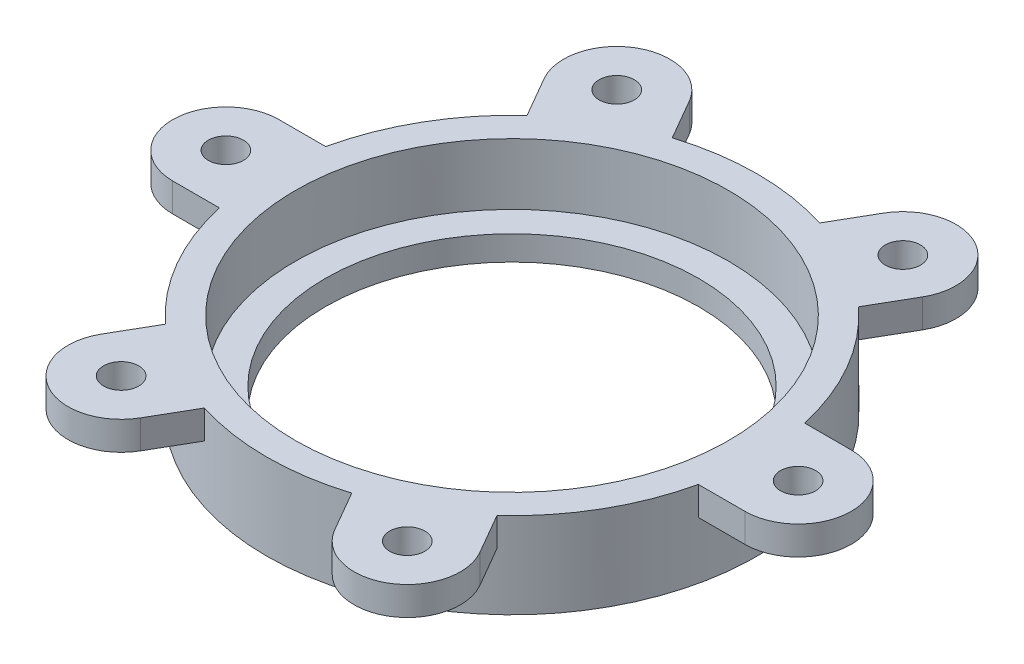
ISO-10303-21;
HEADER;
FILE_DESCRIPTION(('STEP AP214'),'2;1');
FILE_NAME('part.step','',(''),(''),'','','');
FILE_SCHEMA(('AUTOMOTIVE_DESIGN { 1 0 10303 214 1 1 1 1 }'));
ENDSEC;
DATA;
#1=APPLICATION_CONTEXT('core data for automotive mechanical design processes');
#2=APPLICATION_PROTOCOL_DEFINITION('international standard','automotive_design',2000,#1);
#3=PRODUCT_CONTEXT('',#1,'mechanical');
#4=PRODUCT('Part','Part','',(#3));
#5=PRODUCT_RELATED_PRODUCT_CATEGORY('part','',(#4));
#6=PRODUCT_DEFINITION_FORMATION('','',#4);
#7=PRODUCT_DEFINITION_CONTEXT('part definition',#1,'design');
#8=PRODUCT_DEFINITION('design','',#6,#7);
#9=PRODUCT_DEFINITION_SHAPE('','',#8);
#10=(LENGTH_UNIT() NAMED_UNIT(*) SI_UNIT(.MILLI.,.METRE.));
#11=(NAMED_UNIT(*) PLANE_ANGLE_UNIT() SI_UNIT($,.RADIAN.));
#12=(NAMED_UNIT(*) SI_UNIT($,.STERADIAN.) SOLID_ANGLE_UNIT());
#13=UNCERTAINTY_MEASURE_WITH_UNIT(LENGTH_MEASURE(1.E-05),#10,'distance_accuracy_value','');
#14=(GEOMETRIC_REPRESENTATION_CONTEXT(3) GLOBAL_UNCERTAINTY_ASSIGNED_CONTEXT((#13)) GLOBAL_UNIT_ASSIGNED_CONTEXT((#10,
#11,#12)) REPRESENTATION_CONTEXT('',''));
#15=CARTESIAN_POINT('',(0.,0.,0.));
#16=DIRECTION('',(0.,0.,1.));
#17=DIRECTION('',(1.,0.,0.));
#18=AXIS2_PLACEMENT_3D('',#15,#16,#17);
#19=CARTESIAN_POINT('',(35.,0.,0.));
#20=DIRECTION('',(0.,1.,0.));
#21=DIRECTION('',(0.,0.,1.));
#22=AXIS2_PLACEMENT_3D('',#19,#20,#21);
#23=PLANE('',#22);
#24=CARTESIAN_POINT('',(0.,0.,0.));
#25=DIRECTION('',(0.,-1.,0.));
#26=DIRECTION('',(0.,0.,-1.));
#27=AXIS2_PLACEMENT_3D('',#24,#25,#26);
#28=CIRCLE('',#27,22.85);
#29=CARTESIAN_POINT('',(0.,0.,-22.85));
#30=VERTEX_POINT('',#29);
#31=EDGE_CURVE('E281',#30,#30,#28,.T.);
#32=ORIENTED_EDGE('',*,*,#31,.F.);
#33=EDGE_LOOP('',(#32));
#34=FACE_BOUND('',#33,.T.);
#35=CARTESIAN_POINT('',(0.,0.,0.));
#36=DIRECTION('',(0.,1.,0.));
#37=DIRECTION('',(0.,0.,1.));
#38=AXIS2_PLACEMENT_3D('',#35,#36,#37);
#39=CIRCLE('',#38,30.);
#40=CARTESIAN_POINT('',(0.,0.,30.));
#41=VERTEX_POINT('',#40);
#42=EDGE_CURVE('E305',#41,#41,#39,.T.);
#43=ORIENTED_EDGE('',*,*,#42,.F.);
#44=EDGE_LOOP('',(#43));
#45=FACE_BOUND('',#44,.T.);
#46=ADVANCED_FACE('F35',(#34,#45),#23,.F.);
#47=CARTESIAN_POINT('',(35.,10.5,0.));
#48=DIRECTION('',(0.,-1.,0.));
#49=DIRECTION('',(0.,0.,-1.));
#50=AXIS2_PLACEMENT_3D('',#47,#48,#49);
#51=CYLINDRICAL_SURFACE('',#50,6.5);
#52=CARTESIAN_POINT('',(35.,7.,0.));
#53=DIRECTION('',(0.,-1.,0.));
#54=DIRECTION('',(0.,0.,-1.));
#55=AXIS2_PLACEMENT_3D('',#52,#53,#54);
#56=CIRCLE('',#55,6.5);
#57=CARTESIAN_POINT('',(35.,7.,-6.5));
#58=VERTEX_POINT('',#57);
#59=CARTESIAN_POINT('',(35.,7.,6.5));
#60=VERTEX_POINT('',#59);
#61=EDGE_CURVE('E251',#58,#60,#56,.T.);
#62=ORIENTED_EDGE('',*,*,#61,.F.);
#63=DIRECTION('',(0.,-1.,0.));
#64=VECTOR('',#63,1.);
#65=CARTESIAN_POINT('',(35.,10.5,-6.5));
#66=LINE('',#65,#64);
#67=CARTESIAN_POINT('',(35.,10.5,-6.5));
#68=VERTEX_POINT('',#67);
#69=EDGE_CURVE('E11',#68,#58,#66,.T.);
#70=ORIENTED_EDGE('',*,*,#69,.F.);
#71=CARTESIAN_POINT('',(35.,10.5,0.));
#72=DIRECTION('',(0.,1.,0.));
#73=DIRECTION('',(0.,0.,1.));
#74=AXIS2_PLACEMENT_3D('',#71,#72,#73);
#75=CIRCLE('',#74,6.5);
#76=CARTESIAN_POINT('',(35.,10.5,6.5));
#77=VERTEX_POINT('',#76);
#78=EDGE_CURVE('E306',#77,#68,#75,.T.);
#79=ORIENTED_EDGE('',*,*,#78,.F.);
#80=DIRECTION('',(0.,-1.,0.));
#81=VECTOR('',#80,1.);
#82=CARTESIAN_POINT('',(35.,10.5,6.5));
#83=LINE('',#82,#81);
#84=EDGE_CURVE('E350',#77,#60,#83,.T.);
#85=ORIENTED_EDGE('',*,*,#84,.T.);
#86=EDGE_LOOP('',(#62,#70,#79,#85));
#87=FACE_BOUND('',#86,.T.);
#88=ADVANCED_FACE('F37',(#87),#51,.T.);
#89=CARTESIAN_POINT('',(35.,10.5,-6.5));
#90=DIRECTION('',(0.,0.,1.));
#91=DIRECTION('',(1.,0.,0.));
#92=AXIS2_PLACEMENT_3D('',#89,#90,#91);
#93=PLANE('',#92);
#94=DIRECTION('',(1.,0.,0.));
#95=VECTOR('',#94,1.);
#96=CARTESIAN_POINT('',(35.,7.,-6.5));
#97=LINE('',#96,#95);
#98=CARTESIAN_POINT('',(29.2873692912149,7.,-6.5));
#99=VERTEX_POINT('',#98);
#100=EDGE_CURVE('E246',#99,#58,#97,.T.);
#101=ORIENTED_EDGE('',*,*,#100,.F.);
#102=DIRECTION('',(0.,-1.,0.));
#103=VECTOR('',#102,1.);
#104=CARTESIAN_POINT('',(29.2873692912149,10.5,-6.5));
#105=LINE('',#104,#103);
#106=CARTESIAN_POINT('',(29.2873692912149,10.5,-6.5));
#107=VERTEX_POINT('',#106);
#108=EDGE_CURVE('E44',#107,#99,#105,.T.);
#109=ORIENTED_EDGE('',*,*,#108,.F.);
#110=DIRECTION('',(-1.,0.,0.));
#111=VECTOR('',#110,1.);
#112=CARTESIAN_POINT('',(35.,10.5,-6.5));
#113=LINE('',#112,#111);
#114=EDGE_CURVE('E245',#68,#107,#113,.T.);
#115=ORIENTED_EDGE('',*,*,#114,.F.);
#116=ORIENTED_EDGE('',*,*,#69,.T.);
#117=EDGE_LOOP('',(#101,#109,#115,#116));
#118=FACE_BOUND('',#117,.T.);
#119=ADVANCED_FACE('F244',(#118),#93,.F.);
#120=CARTESIAN_POINT('',(23.1291651245992,10.5,-27.0608891324551));
#121=DIRECTION('',(-0.866025403784433,0.,-0.50000000000001));
#122=DIRECTION('',(-0.50000000000001,0.,0.866025403784433));
#123=AXIS2_PLACEMENT_3D('',#120,#121,#122);
#124=PLANE('',#123);
#125=DIRECTION('',(-0.50000000000001,0.,0.866025403784433));
#126=VECTOR('',#125,1.);
#127=CARTESIAN_POINT('',(23.1291651245992,7.,-27.0608891324551));
#128=LINE('',#127,#126);
#129=CARTESIAN_POINT('',(23.1291651245992,7.,-27.0608891324551));
#130=VERTEX_POINT('',#129);
#131=CARTESIAN_POINT('',(20.2728497702066,7.,-22.1136058162081));
#132=VERTEX_POINT('',#131);
#133=EDGE_CURVE('E204',#130,#132,#128,.T.);
#134=ORIENTED_EDGE('',*,*,#133,.F.);
#135=DIRECTION('',(0.,-1.,0.));
#136=VECTOR('',#135,1.);
#137=CARTESIAN_POINT('',(23.1291651245992,10.5,-27.0608891324551));
#138=LINE('',#137,#136);
#139=CARTESIAN_POINT('',(23.1291651245992,10.5,-27.0608891324551));
#140=VERTEX_POINT('',#139);
#141=EDGE_CURVE('E228',#140,#130,#138,.T.);
#142=ORIENTED_EDGE('',*,*,#141,.F.);
#143=DIRECTION('',(0.50000000000001,0.,-0.866025403784433));
#144=VECTOR('',#143,1.);
#145=CARTESIAN_POINT('',(23.1291651245992,10.5,-27.0608891324551));
#146=LINE('',#145,#144);
#147=CARTESIAN_POINT('',(20.2728497702066,10.5,-22.1136058162081));
#148=VERTEX_POINT('',#147);
#149=EDGE_CURVE('E310',#148,#140,#146,.T.);
#150=ORIENTED_EDGE('',*,*,#149,.F.);
#151=DIRECTION('',(0.,-1.,0.));
#152=VECTOR('',#151,1.);
#153=CARTESIAN_POINT('',(20.2728497702066,10.5,-22.1136058162081));
#154=LINE('',#153,#152);
#155=EDGE_CURVE('E237',#148,#132,#154,.T.);
#156=ORIENTED_EDGE('',*,*,#155,.T.);
#157=EDGE_LOOP('',(#134,#142,#150,#156));
#158=FACE_BOUND('',#157,.T.);
#159=ADVANCED_FACE('F758',(#158),#124,.F.);
#160=CARTESIAN_POINT('',(17.5000000000004,10.5,-30.3108891324551));
#161=DIRECTION('',(0.,-1.,0.));
#162=DIRECTION('',(0.,0.,-1.));
#163=AXIS2_PLACEMENT_3D('',#160,#161,#162);
#164=CYLINDRICAL_SURFACE('',#163,6.5);
#165=CARTESIAN_POINT('',(17.5000000000004,7.,-30.3108891324551));
#166=DIRECTION('',(0.,-1.,0.));
#167=DIRECTION('',(0.,0.,-1.));
#168=AXIS2_PLACEMENT_3D('',#165,#166,#167);
#169=CIRCLE('',#168,6.5);
#170=CARTESIAN_POINT('',(11.8708348754015,7.,-33.5608891324552));
#171=VERTEX_POINT('',#170);
#172=EDGE_CURVE('E219',#171,#130,#169,.T.);
#173=ORIENTED_EDGE('',*,*,#172,.F.);
#174=DIRECTION('',(0.,-1.,0.));
#175=VECTOR('',#174,1.);
#176=CARTESIAN_POINT('',(11.8708348754015,10.5,-33.5608891324552));
#177=LINE('',#176,#175);
#178=CARTESIAN_POINT('',(11.8708348754015,10.5,-33.5608891324552));
#179=VERTEX_POINT('',#178);
#180=EDGE_CURVE('E218',#179,#171,#177,.T.);
#181=ORIENTED_EDGE('',*,*,#180,.F.);
#182=CARTESIAN_POINT('',(17.5000000000004,10.5,-30.3108891324551));
#183=DIRECTION('',(0.,1.,0.));
#184=DIRECTION('',(0.,0.,1.));
#185=AXIS2_PLACEMENT_3D('',#182,#183,#184);
#186=CIRCLE('',#185,6.5);
#187=EDGE_CURVE('E312',#140,#179,#186,.T.);
#188=ORIENTED_EDGE('',*,*,#187,.F.);
#189=ORIENTED_EDGE('',*,*,#141,.T.);
#190=EDGE_LOOP('',(#173,#181,#188,#189));
#191=FACE_BOUND('',#190,.T.);
#192=ADVANCED_FACE('F766',(#191),#164,.T.);
#193=CARTESIAN_POINT('',(11.8708348754015,10.5,-33.5608891324552));
#194=DIRECTION('',(0.866025403784433,0.,0.50000000000001));
#195=DIRECTION('',(0.50000000000001,0.,-0.866025403784433));
#196=AXIS2_PLACEMENT_3D('',#193,#194,#195);
#197=PLANE('',#196);
#198=DIRECTION('',(0.50000000000001,0.,-0.866025403784433));
#199=VECTOR('',#198,1.);
#200=CARTESIAN_POINT('',(11.8708348754015,7.,-33.5608891324552));
#201=LINE('',#200,#199);
#202=CARTESIAN_POINT('',(9.01451952100896,7.,-28.6136058162083));
#203=VERTEX_POINT('',#202);
#204=EDGE_CURVE('E201',#203,#171,#201,.T.);
#205=ORIENTED_EDGE('',*,*,#204,.F.);
#206=DIRECTION('',(0.,-1.,0.));
#207=VECTOR('',#206,1.);
#208=CARTESIAN_POINT('',(9.01451952100896,10.5,-28.6136058162083));
#209=LINE('',#208,#207);
#210=CARTESIAN_POINT('',(9.01451952100896,10.5,-28.6136058162083));
#211=VERTEX_POINT('',#210);
#212=EDGE_CURVE('E215',#211,#203,#209,.T.);
#213=ORIENTED_EDGE('',*,*,#212,.F.);
#214=DIRECTION('',(-0.50000000000001,0.,0.866025403784433));
#215=VECTOR('',#214,1.);
#216=CARTESIAN_POINT('',(11.8708348754015,10.5,-33.5608891324552));
#217=LINE('',#216,#215);
#218=EDGE_CURVE('E314',#179,#211,#217,.T.);
#219=ORIENTED_EDGE('',*,*,#218,.F.);
#220=ORIENTED_EDGE('',*,*,#180,.T.);
#221=EDGE_LOOP('',(#205,#213,#219,#220));
#222=FACE_BOUND('',#221,.T.);
#223=ADVANCED_FACE('F213',(#222),#197,.F.);
#224=CARTESIAN_POINT('',(-11.8708348754008,10.5,-33.5608891324555));
#225=DIRECTION('',(-0.866025403784443,0.,0.499999999999992));
#226=DIRECTION('',(0.499999999999992,0.,0.866025403784443));
#227=AXIS2_PLACEMENT_3D('',#224,#225,#226);
#228=PLANE('',#227);
#229=DIRECTION('',(0.499999999999992,0.,0.866025403784443));
#230=VECTOR('',#229,1.);
#231=CARTESIAN_POINT('',(-11.8708348754008,7.,-33.5608891324555));
#232=LINE('',#231,#230);
#233=CARTESIAN_POINT('',(-11.8708348754008,7.,-33.5608891324555));
#234=VERTEX_POINT('',#233);
#235=CARTESIAN_POINT('',(-9.01451952100835,7.,-28.6136058162085));
#236=VERTEX_POINT('',#235);
#237=EDGE_CURVE('E220',#234,#236,#232,.T.);
#238=ORIENTED_EDGE('',*,*,#237,.F.);
#239=DIRECTION('',(0.,-1.,0.));
#240=VECTOR('',#239,1.);
#241=CARTESIAN_POINT('',(-11.8708348754008,10.5,-33.5608891324555));
#242=LINE('',#241,#240);
#243=CARTESIAN_POINT('',(-11.8708348754008,10.5,-33.5608891324555));
#244=VERTEX_POINT('',#243);
#245=EDGE_CURVE('E231',#244,#234,#242,.T.);
#246=ORIENTED_EDGE('',*,*,#245,.F.);
#247=DIRECTION('',(-0.499999999999992,0.,-0.866025403784443));
#248=VECTOR('',#247,1.);
#249=CARTESIAN_POINT('',(-11.8708348754008,10.5,-33.5608891324555));
#250=LINE('',#249,#248);
#251=CARTESIAN_POINT('',(-9.01451952100835,10.5,-28.6136058162085));
#252=VERTEX_POINT('',#251);
#253=EDGE_CURVE('E317',#252,#244,#250,.T.);
#254=ORIENTED_EDGE('',*,*,#253,.F.);
#255=DIRECTION('',(0.,-1.,0.));
#256=VECTOR('',#255,1.);
#257=CARTESIAN_POINT('',(-9.01451952100835,10.5,-28.6136058162085));
#258=LINE('',#257,#256);
#259=EDGE_CURVE('E226',#252,#236,#258,.T.);
#260=ORIENTED_EDGE('',*,*,#259,.T.);
#261=EDGE_LOOP('',(#238,#246,#254,#260));
#262=FACE_BOUND('',#261,.T.);
#263=ADVANCED_FACE('F409',(#262),#228,.F.);
#264=CARTESIAN_POINT('',(-17.4999999999997,10.5,-30.3108891324555));
#265=DIRECTION('',(0.,-1.,0.));
#266=DIRECTION('',(0.,0.,-1.));
#267=AXIS2_PLACEMENT_3D('',#264,#265,#266);
#268=CYLINDRICAL_SURFACE('',#267,6.5);
#269=CARTESIAN_POINT('',(-17.4999999999997,7.,-30.3108891324555));
#270=DIRECTION('',(0.,-1.,0.));
#271=DIRECTION('',(0.,0.,-1.));
#272=AXIS2_PLACEMENT_3D('',#269,#270,#271);
#273=CIRCLE('',#272,6.5);
#274=CARTESIAN_POINT('',(-23.1291651245986,7.,-27.0608891324556));
#275=VERTEX_POINT('',#274);
#276=EDGE_CURVE('E276',#275,#234,#273,.T.);
#277=ORIENTED_EDGE('',*,*,#276,.F.);
#278=DIRECTION('',(0.,-1.,0.));
#279=VECTOR('',#278,1.);
#280=CARTESIAN_POINT('',(-23.1291651245986,10.5,-27.0608891324556));
#281=LINE('',#280,#279);
#282=CARTESIAN_POINT('',(-23.1291651245986,10.5,-27.0608891324556));
#283=VERTEX_POINT('',#282);
#284=EDGE_CURVE('E397',#283,#275,#281,.T.);
#285=ORIENTED_EDGE('',*,*,#284,.F.);
#286=CARTESIAN_POINT('',(-17.4999999999997,10.5,-30.3108891324555));
#287=DIRECTION('',(0.,1.,0.));
#288=DIRECTION('',(0.,0.,1.));
#289=AXIS2_PLACEMENT_3D('',#286,#287,#288);
#290=CIRCLE('',#289,6.5);
#291=EDGE_CURVE('E319',#244,#283,#290,.T.);
#292=ORIENTED_EDGE('',*,*,#291,.F.);
#293=ORIENTED_EDGE('',*,*,#245,.T.);
#294=EDGE_LOOP('',(#277,#285,#292,#293));
#295=FACE_BOUND('',#294,.T.);
#296=ADVANCED_FACE('F404',(#295),#268,.T.);
#297=CARTESIAN_POINT('',(-23.1291651245986,10.5,-27.0608891324556));
#298=DIRECTION('',(0.866025403784443,0.,-0.499999999999992));
#299=DIRECTION('',(-0.499999999999992,0.,-0.866025403784443));
#300=AXIS2_PLACEMENT_3D('',#297,#298,#299);
#301=PLANE('',#300);
#302=DIRECTION('',(-0.499999999999992,0.,-0.866025403784443));
#303=VECTOR('',#302,1.);
#304=CARTESIAN_POINT('',(-23.1291651245986,7.,-27.0608891324556));
#305=LINE('',#304,#303);
#306=CARTESIAN_POINT('',(-20.2728497702061,7.,-22.1136058162086));
#307=VERTEX_POINT('',#306);
#308=EDGE_CURVE('E274',#307,#275,#305,.T.);
#309=ORIENTED_EDGE('',*,*,#308,.F.);
#310=DIRECTION('',(0.,-1.,0.));
#311=VECTOR('',#310,1.);
#312=CARTESIAN_POINT('',(-20.2728497702061,10.5,-22.1136058162086));
#313=LINE('',#312,#311);
#314=CARTESIAN_POINT('',(-20.2728497702061,10.5,-22.1136058162086));
#315=VERTEX_POINT('',#314);
#316=EDGE_CURVE('E394',#315,#307,#313,.T.);
#317=ORIENTED_EDGE('',*,*,#316,.F.);
#318=DIRECTION('',(0.499999999999992,0.,0.866025403784443));
#319=VECTOR('',#318,1.);
#320=CARTESIAN_POINT('',(-23.1291651245986,10.5,-27.0608891324556));
#321=LINE('',#320,#319);
#322=EDGE_CURVE('E321',#283,#315,#321,.T.);
#323=ORIENTED_EDGE('',*,*,#322,.F.);
#324=ORIENTED_EDGE('',*,*,#284,.T.);
#325=EDGE_LOOP('',(#309,#317,#323,#324));
#326=FACE_BOUND('',#325,.T.);
#327=ADVANCED_FACE('F500',(#326),#301,.F.);
#328=CARTESIAN_POINT('',(-35.,10.5,-6.50000000000025));
#329=DIRECTION('',(0.,0.,1.));
#330=DIRECTION('',(1.,0.,0.));
#331=AXIS2_PLACEMENT_3D('',#328,#329,#330);
#332=PLANE('',#331);
#333=DIRECTION('',(1.,0.,0.));
#334=VECTOR('',#333,1.);
#335=CARTESIAN_POINT('',(-35.,7.,-6.50000000000025));
#336=LINE('',#335,#334);
#337=CARTESIAN_POINT('',(-35.,7.,-6.50000000000025));
#338=VERTEX_POINT('',#337);
#339=CARTESIAN_POINT('',(-29.2873692912149,7.,-6.5000000000002));
#340=VERTEX_POINT('',#339);
#341=EDGE_CURVE('E272',#338,#340,#336,.T.);
#342=ORIENTED_EDGE('',*,*,#341,.F.);
#343=DIRECTION('',(0.,-1.,0.));
#344=VECTOR('',#343,1.);
#345=CARTESIAN_POINT('',(-35.,10.5,-6.50000000000025));
#346=LINE('',#345,#344);
#347=CARTESIAN_POINT('',(-35.,10.5,-6.50000000000025));
#348=VERTEX_POINT('',#347);
#349=EDGE_CURVE('E388',#348,#338,#346,.T.);
#350=ORIENTED_EDGE('',*,*,#349,.F.);
#351=DIRECTION('',(-1.,0.,0.));
#352=VECTOR('',#351,1.);
#353=CARTESIAN_POINT('',(-35.,10.5,-6.50000000000025));
#354=LINE('',#353,#352);
#355=CARTESIAN_POINT('',(-29.2873692912149,10.5,-6.50000000000021));
#356=VERTEX_POINT('',#355);
#357=EDGE_CURVE('E325',#356,#348,#354,.T.);
#358=ORIENTED_EDGE('',*,*,#357,.F.);
#359=DIRECTION('',(0.,-1.,0.));
#360=VECTOR('',#359,1.);
#361=CARTESIAN_POINT('',(-29.2873692912149,10.5,-6.50000000000021));
#362=LINE('',#361,#360);
#363=EDGE_CURVE('E391',#356,#340,#362,.T.);
#364=ORIENTED_EDGE('',*,*,#363,.T.);
#365=EDGE_LOOP('',(#342,#350,#358,#364));
#366=FACE_BOUND('',#365,.T.);
#367=ADVANCED_FACE('F497',(#366),#332,.F.);
#368=CARTESIAN_POINT('',(-35.,10.5,-2.44403693719019E-13));
#369=DIRECTION('',(0.,-1.,0.));
#370=DIRECTION('',(0.,0.,-1.));
#371=AXIS2_PLACEMENT_3D('',#368,#369,#370);
#372=CYLINDRICAL_SURFACE('',#371,6.5);
#373=CARTESIAN_POINT('',(-35.,7.,-2.44403693719019E-13));
#374=DIRECTION('',(0.,-1.,0.));
#375=DIRECTION('',(0.,0.,-1.));
#376=AXIS2_PLACEMENT_3D('',#373,#374,#375);
#377=CIRCLE('',#376,6.5);
#378=CARTESIAN_POINT('',(-35.,7.,6.49999999999976));
#379=VERTEX_POINT('',#378);
#380=EDGE_CURVE('E270',#379,#338,#377,.T.);
#381=ORIENTED_EDGE('',*,*,#380,.F.);
#382=DIRECTION('',(0.,-1.,0.));
#383=VECTOR('',#382,1.);
#384=CARTESIAN_POINT('',(-35.,10.5,6.49999999999976));
#385=LINE('',#384,#383);
#386=CARTESIAN_POINT('',(-35.,10.5,6.49999999999976));
#387=VERTEX_POINT('',#386);
#388=EDGE_CURVE('E385',#387,#379,#385,.T.);
#389=ORIENTED_EDGE('',*,*,#388,.F.);
#390=CARTESIAN_POINT('',(-35.,10.5,-2.44403693719019E-13));
#391=DIRECTION('',(0.,1.,0.));
#392=DIRECTION('',(0.,0.,1.));
#393=AXIS2_PLACEMENT_3D('',#390,#391,#392);
#394=CIRCLE('',#393,6.5);
#395=EDGE_CURVE('E327',#348,#387,#394,.T.);
#396=ORIENTED_EDGE('',*,*,#395,.F.);
#397=ORIENTED_EDGE('',*,*,#349,.T.);
#398=EDGE_LOOP('',(#381,#389,#396,#397));
#399=FACE_BOUND('',#398,.T.);
#400=ADVANCED_FACE('F492',(#399),#372,.T.);
#401=CARTESIAN_POINT('',(-35.,10.5,6.49999999999976));
#402=DIRECTION('',(0.,0.,-1.));
#403=DIRECTION('',(-1.,0.,0.));
#404=AXIS2_PLACEMENT_3D('',#401,#402,#403);
#405=PLANE('',#404);
#406=DIRECTION('',(-1.,0.,0.));
#407=VECTOR('',#406,1.);
#408=CARTESIAN_POINT('',(-35.,7.,6.49999999999976));
#409=LINE('',#408,#407);
#410=CARTESIAN_POINT('',(-29.287369291215,7.,6.4999999999998));
#411=VERTEX_POINT('',#410);
#412=EDGE_CURVE('E268',#411,#379,#409,.T.);
#413=ORIENTED_EDGE('',*,*,#412,.F.);
#414=DIRECTION('',(0.,-1.,0.));
#415=VECTOR('',#414,1.);
#416=CARTESIAN_POINT('',(-29.287369291215,10.5,6.4999999999998));
#417=LINE('',#416,#415);
#418=CARTESIAN_POINT('',(-29.287369291215,10.5,6.4999999999998));
#419=VERTEX_POINT('',#418);
#420=EDGE_CURVE('E382',#419,#411,#417,.T.);
#421=ORIENTED_EDGE('',*,*,#420,.F.);
#422=DIRECTION('',(1.,0.,0.));
#423=VECTOR('',#422,1.);
#424=CARTESIAN_POINT('',(-35.,10.5,6.49999999999976));
#425=LINE('',#424,#423);
#426=EDGE_CURVE('E329',#387,#419,#425,.T.);
#427=ORIENTED_EDGE('',*,*,#426,.F.);
#428=ORIENTED_EDGE('',*,*,#388,.T.);
#429=EDGE_LOOP('',(#413,#421,#427,#428));
#430=FACE_BOUND('',#429,.T.);
#431=ADVANCED_FACE('F485',(#430),#405,.F.);
#432=CARTESIAN_POINT('',(-23.129165124599,10.5,27.0608891324553));
#433=DIRECTION('',(0.866025403784437,0.,0.500000000000003));
#434=DIRECTION('',(0.500000000000003,0.,-0.866025403784437));
#435=AXIS2_PLACEMENT_3D('',#432,#433,#434);
#436=PLANE('',#435);
#437=DIRECTION('',(0.500000000000003,0.,-0.866025403784437));
#438=VECTOR('',#437,1.);
#439=CARTESIAN_POINT('',(-23.129165124599,7.,27.0608891324553));
#440=LINE('',#439,#438);
#441=CARTESIAN_POINT('',(-23.129165124599,7.,27.0608891324553));
#442=VERTEX_POINT('',#441);
#443=CARTESIAN_POINT('',(-20.2728497702064,7.,22.1136058162083));
#444=VERTEX_POINT('',#443);
#445=EDGE_CURVE('E266',#442,#444,#440,.T.);
#446=ORIENTED_EDGE('',*,*,#445,.F.);
#447=DIRECTION('',(0.,-1.,0.));
#448=VECTOR('',#447,1.);
#449=CARTESIAN_POINT('',(-23.129165124599,10.5,27.0608891324553));
#450=LINE('',#449,#448);
#451=CARTESIAN_POINT('',(-23.129165124599,10.5,27.0608891324553));
#452=VERTEX_POINT('',#451);
#453=EDGE_CURVE('E376',#452,#442,#450,.T.);
#454=ORIENTED_EDGE('',*,*,#453,.F.);
#455=DIRECTION('',(-0.500000000000003,0.,0.866025403784437));
#456=VECTOR('',#455,1.);
#457=CARTESIAN_POINT('',(-23.129165124599,10.5,27.0608891324553));
#458=LINE('',#457,#456);
#459=CARTESIAN_POINT('',(-20.2728497702064,10.5,22.1136058162083));
#460=VERTEX_POINT('',#459);
#461=EDGE_CURVE('E333',#460,#452,#458,.T.);
#462=ORIENTED_EDGE('',*,*,#461,.F.);
#463=DIRECTION('',(0.,-1.,0.));
#464=VECTOR('',#463,1.);
#465=CARTESIAN_POINT('',(-20.2728497702064,10.5,22.1136058162083));
#466=LINE('',#465,#464);
#467=EDGE_CURVE('E379',#460,#444,#466,.T.);
#468=ORIENTED_EDGE('',*,*,#467,.T.);
#469=EDGE_LOOP('',(#446,#454,#462,#468));
#470=FACE_BOUND('',#469,.T.);
#471=ADVANCED_FACE('F476',(#470),#436,.F.);
#472=CARTESIAN_POINT('',(-17.5000000000001,10.5,30.3108891324553));
#473=DIRECTION('',(0.,-1.,0.));
#474=DIRECTION('',(0.,0.,-1.));
#475=AXIS2_PLACEMENT_3D('',#472,#473,#474);
#476=CYLINDRICAL_SURFACE('',#475,6.5);
#477=CARTESIAN_POINT('',(-17.5000000000001,7.,30.3108891324553));
#478=DIRECTION('',(0.,-1.,0.));
#479=DIRECTION('',(0.,0.,-1.));
#480=AXIS2_PLACEMENT_3D('',#477,#478,#479);
#481=CIRCLE('',#480,6.5);
#482=CARTESIAN_POINT('',(-11.8708348754013,7.,33.5608891324553));
#483=VERTEX_POINT('',#482);
#484=EDGE_CURVE('E264',#483,#442,#481,.T.);
#485=ORIENTED_EDGE('',*,*,#484,.F.);
#486=DIRECTION('',(0.,-1.,0.));
#487=VECTOR('',#486,1.);
#488=CARTESIAN_POINT('',(-11.8708348754013,10.5,33.5608891324553));
#489=LINE('',#488,#487);
#490=CARTESIAN_POINT('',(-11.8708348754013,10.5,33.5608891324553));
#491=VERTEX_POINT('',#490);
#492=EDGE_CURVE('E373',#491,#483,#489,.T.);
#493=ORIENTED_EDGE('',*,*,#492,.F.);
#494=CARTESIAN_POINT('',(-17.5000000000001,10.5,30.3108891324553));
#495=DIRECTION('',(0.,1.,0.));
#496=DIRECTION('',(0.,0.,1.));
#497=AXIS2_PLACEMENT_3D('',#494,#495,#496);
#498=CIRCLE('',#497,6.5);
#499=EDGE_CURVE('E335',#452,#491,#498,.T.);
#500=ORIENTED_EDGE('',*,*,#499,.F.);
#501=ORIENTED_EDGE('',*,*,#453,.T.);
#502=EDGE_LOOP('',(#485,#493,#500,#501));
#503=FACE_BOUND('',#502,.T.);
#504=ADVANCED_FACE('F536',(#503),#476,.T.);
#505=CARTESIAN_POINT('',(-11.8708348754013,10.5,33.5608891324553));
#506=DIRECTION('',(-0.866025403784436,0.,-0.500000000000004));
#507=DIRECTION('',(-0.500000000000004,0.,0.866025403784436));
#508=AXIS2_PLACEMENT_3D('',#505,#506,#507);
#509=PLANE('',#508);
#510=DIRECTION('',(-0.500000000000004,0.,0.866025403784436));
#511=VECTOR('',#510,1.);
#512=CARTESIAN_POINT('',(-11.8708348754013,7.,33.5608891324553));
#513=LINE('',#512,#511);
#514=CARTESIAN_POINT('',(-9.01451952100875,7.,28.6136058162083));
#515=VERTEX_POINT('',#514);
#516=EDGE_CURVE('E262',#515,#483,#513,.T.);
#517=ORIENTED_EDGE('',*,*,#516,.F.);
#518=DIRECTION('',(0.,-1.,0.));
#519=VECTOR('',#518,1.);
#520=CARTESIAN_POINT('',(-9.01451952100875,10.5,28.6136058162084));
#521=LINE('',#520,#519);
#522=CARTESIAN_POINT('',(-9.01451952100875,10.5,28.6136058162084));
#523=VERTEX_POINT('',#522);
#524=EDGE_CURVE('E370',#523,#515,#521,.T.);
#525=ORIENTED_EDGE('',*,*,#524,.F.);
#526=DIRECTION('',(0.500000000000004,0.,-0.866025403784436));
#527=VECTOR('',#526,1.);
#528=CARTESIAN_POINT('',(-11.8708348754013,10.5,33.5608891324553));
#529=LINE('',#528,#527);
#530=EDGE_CURVE('E337',#491,#523,#529,.T.);
#531=ORIENTED_EDGE('',*,*,#530,.F.);
#532=ORIENTED_EDGE('',*,*,#492,.T.);
#533=EDGE_LOOP('',(#517,#525,#531,#532));
#534=FACE_BOUND('',#533,.T.);
#535=ADVANCED_FACE('F533',(#534),#509,.F.);
#536=CARTESIAN_POINT('',(11.8708348754011,10.5,33.5608891324554));
#537=DIRECTION('',(0.86602540378444,0.,-0.499999999999998));
#538=DIRECTION('',(-0.499999999999998,0.,-0.86602540378444));
#539=AXIS2_PLACEMENT_3D('',#536,#537,#538);
#540=PLANE('',#539);
#541=DIRECTION('',(-0.499999999999998,0.,-0.86602540378444));
#542=VECTOR('',#541,1.);
#543=CARTESIAN_POINT('',(11.8708348754011,7.,33.5608891324554));
#544=LINE('',#543,#542);
#545=CARTESIAN_POINT('',(11.8708348754011,7.,33.5608891324554));
#546=VERTEX_POINT('',#545);
#547=CARTESIAN_POINT('',(9.01451952100855,7.,28.6136058162084));
#548=VERTEX_POINT('',#547);
#549=EDGE_CURVE('E260',#546,#548,#544,.T.);
#550=ORIENTED_EDGE('',*,*,#549,.F.);
#551=DIRECTION('',(0.,-1.,0.));
#552=VECTOR('',#551,1.);
#553=CARTESIAN_POINT('',(11.8708348754011,10.5,33.5608891324554));
#554=LINE('',#553,#552);
#555=CARTESIAN_POINT('',(11.8708348754011,10.5,33.5608891324554));
#556=VERTEX_POINT('',#555);
#557=EDGE_CURVE('E364',#556,#546,#554,.T.);
#558=ORIENTED_EDGE('',*,*,#557,.F.);
#559=DIRECTION('',(0.499999999999998,0.,0.86602540378444));
#560=VECTOR('',#559,1.);
#561=CARTESIAN_POINT('',(11.8708348754011,10.5,33.5608891324554));
#562=LINE('',#561,#560);
#563=CARTESIAN_POINT('',(9.01451952100856,10.5,28.6136058162084));
#564=VERTEX_POINT('',#563);
#565=EDGE_CURVE('E341',#564,#556,#562,.T.);
#566=ORIENTED_EDGE('',*,*,#565,.F.);
#567=DIRECTION('',(0.,-1.,0.));
#568=VECTOR('',#567,1.);
#569=CARTESIAN_POINT('',(9.01451952100856,10.5,28.6136058162084));
#570=LINE('',#569,#568);
#571=EDGE_CURVE('E367',#564,#548,#570,.T.);
#572=ORIENTED_EDGE('',*,*,#571,.T.);
#573=EDGE_LOOP('',(#550,#558,#566,#572));
#574=FACE_BOUND('',#573,.T.);
#575=ADVANCED_FACE('F464',(#574),#540,.F.);
#576=CARTESIAN_POINT('',(17.4999999999999,10.5,30.3108891324554));
#577=DIRECTION('',(0.,-1.,0.));
#578=DIRECTION('',(0.,0.,-1.));
#579=AXIS2_PLACEMENT_3D('',#576,#577,#578);
#580=CYLINDRICAL_SURFACE('',#579,6.5);
#581=CARTESIAN_POINT('',(17.4999999999999,7.,30.3108891324554));
#582=DIRECTION('',(0.,-1.,0.));
#583=DIRECTION('',(0.,0.,-1.));
#584=AXIS2_PLACEMENT_3D('',#581,#582,#583);
#585=CIRCLE('',#584,6.5);
#586=CARTESIAN_POINT('',(23.1291651245988,7.,27.0608891324554));
#587=VERTEX_POINT('',#586);
#588=EDGE_CURVE('E253',#587,#546,#585,.T.);
#589=ORIENTED_EDGE('',*,*,#588,.F.);
#590=DIRECTION('',(0.,-1.,0.));
#591=VECTOR('',#590,1.);
#592=CARTESIAN_POINT('',(23.1291651245988,10.5,27.0608891324554));
#593=LINE('',#592,#591);
#594=CARTESIAN_POINT('',(23.1291651245988,10.5,27.0608891324554));
#595=VERTEX_POINT('',#594);
#596=EDGE_CURVE('E361',#595,#587,#593,.T.);
#597=ORIENTED_EDGE('',*,*,#596,.F.);
#598=CARTESIAN_POINT('',(17.4999999999999,10.5,30.3108891324554));
#599=DIRECTION('',(0.,1.,0.));
#600=DIRECTION('',(0.,0.,1.));
#601=AXIS2_PLACEMENT_3D('',#598,#599,#600);
#602=CIRCLE('',#601,6.5);
#603=EDGE_CURVE('E343',#556,#595,#602,.T.);
#604=ORIENTED_EDGE('',*,*,#603,.F.);
#605=ORIENTED_EDGE('',*,*,#557,.T.);
#606=EDGE_LOOP('',(#589,#597,#604,#605));
#607=FACE_BOUND('',#606,.T.);
#608=ADVANCED_FACE('F460',(#607),#580,.T.);
#609=CARTESIAN_POINT('',(23.1291651245988,10.5,27.0608891324554));
#610=DIRECTION('',(-0.86602540378444,0.,0.499999999999998));
#611=DIRECTION('',(0.499999999999998,0.,0.86602540378444));
#612=AXIS2_PLACEMENT_3D('',#609,#610,#611);
#613=PLANE('',#612);
#614=DIRECTION('',(0.499999999999998,0.,0.86602540378444));
#615=VECTOR('',#614,1.);
#616=CARTESIAN_POINT('',(23.1291651245988,7.,27.0608891324554));
#617=LINE('',#616,#615);
#618=CARTESIAN_POINT('',(20.2728497702063,7.,22.1136058162084));
#619=VERTEX_POINT('',#618);
#620=EDGE_CURVE('E250',#619,#587,#617,.T.);
#621=ORIENTED_EDGE('',*,*,#620,.F.);
#622=DIRECTION('',(0.,-1.,0.));
#623=VECTOR('',#622,1.);
#624=CARTESIAN_POINT('',(20.2728497702063,10.5,22.1136058162084));
#625=LINE('',#624,#623);
#626=CARTESIAN_POINT('',(20.2728497702063,10.5,22.1136058162084));
#627=VERTEX_POINT('',#626);
#628=EDGE_CURVE('E358',#627,#619,#625,.T.);
#629=ORIENTED_EDGE('',*,*,#628,.F.);
#630=DIRECTION('',(-0.499999999999998,0.,-0.86602540378444));
#631=VECTOR('',#630,1.);
#632=CARTESIAN_POINT('',(23.1291651245988,10.5,27.0608891324554));
#633=LINE('',#632,#631);
#634=EDGE_CURVE('E345',#595,#627,#633,.T.);
#635=ORIENTED_EDGE('',*,*,#634,.F.);
#636=ORIENTED_EDGE('',*,*,#596,.T.);
#637=EDGE_LOOP('',(#621,#629,#635,#636));
#638=FACE_BOUND('',#637,.T.);
#639=ADVANCED_FACE('F453',(#638),#613,.F.);
#640=CARTESIAN_POINT('',(35.,10.5,6.5));
#641=DIRECTION('',(0.,0.,-1.));
#642=DIRECTION('',(-1.,0.,0.));
#643=AXIS2_PLACEMENT_3D('',#640,#641,#642);
#644=PLANE('',#643);
#645=DIRECTION('',(-1.,0.,0.));
#646=VECTOR('',#645,1.);
#647=CARTESIAN_POINT('',(35.,7.,6.5));
#648=LINE('',#647,#646);
#649=CARTESIAN_POINT('',(29.2873692912149,7.,6.5));
#650=VERTEX_POINT('',#649);
#651=EDGE_CURVE('E255',#60,#650,#648,.T.);
#652=ORIENTED_EDGE('',*,*,#651,.F.);
#653=ORIENTED_EDGE('',*,*,#84,.F.);
#654=DIRECTION('',(1.,0.,0.));
#655=VECTOR('',#654,1.);
#656=CARTESIAN_POINT('',(35.,10.5,6.5));
#657=LINE('',#656,#655);
#658=CARTESIAN_POINT('',(29.2873692912149,10.5,6.5));
#659=VERTEX_POINT('',#658);
#660=EDGE_CURVE('E59',#659,#77,#657,.T.);
#661=ORIENTED_EDGE('',*,*,#660,.F.);
#662=DIRECTION('',(0.,-1.,0.));
#663=VECTOR('',#662,1.);
#664=CARTESIAN_POINT('',(29.2873692912149,10.5,6.5));
#665=LINE('',#664,#663);
#666=EDGE_CURVE('E355',#659,#650,#665,.T.);
#667=ORIENTED_EDGE('',*,*,#666,.T.);
#668=EDGE_LOOP('',(#652,#653,#661,#667));
#669=FACE_BOUND('',#668,.T.);
#670=ADVANCED_FACE('F442',(#669),#644,.F.);
#671=CARTESIAN_POINT('',(35.,10.5,0.));
#672=DIRECTION('',(0.,-1.,0.));
#673=DIRECTION('',(0.,0.,-1.));
#674=AXIS2_PLACEMENT_3D('',#671,#672,#673);
#675=CYLINDRICAL_SURFACE('',#674,2.15);
#676=CARTESIAN_POINT('',(35.,10.5,0.));
#677=DIRECTION('',(0.,1.,0.));
#678=DIRECTION('',(0.,0.,1.));
#679=AXIS2_PLACEMENT_3D('',#676,#677,#678);
#680=CIRCLE('',#679,2.15);
#681=CARTESIAN_POINT('',(35.,10.5,2.15));
#682=VERTEX_POINT('',#681);
#683=EDGE_CURVE('E302',#682,#682,#680,.T.);
#684=ORIENTED_EDGE('',*,*,#683,.T.);
#685=EDGE_LOOP('',(#684));
#686=FACE_BOUND('',#685,.T.);
#687=CARTESIAN_POINT('',(35.,7.,0.));
#688=DIRECTION('',(0.,-1.,0.));
#689=DIRECTION('',(0.,0.,-1.));
#690=AXIS2_PLACEMENT_3D('',#687,#688,#689);
#691=CIRCLE('',#690,2.15);
#692=CARTESIAN_POINT('',(35.,7.,-2.15));
#693=VERTEX_POINT('',#692);
#694=EDGE_CURVE('E437',#693,#693,#691,.T.);
#695=ORIENTED_EDGE('',*,*,#694,.T.);
#696=EDGE_LOOP('',(#695));
#697=FACE_BOUND('',#696,.T.);
#698=ADVANCED_FACE('F523',(#686,#697),#675,.F.);
#699=CARTESIAN_POINT('',(17.4999999999999,10.5,30.3108891324554));
#700=DIRECTION('',(0.,-1.,0.));
#701=DIRECTION('',(0.,0.,-1.));
#702=AXIS2_PLACEMENT_3D('',#699,#700,#701);
#703=CYLINDRICAL_SURFACE('',#702,2.15);
#704=CARTESIAN_POINT('',(17.4999999999999,10.5,30.3108891324554));
#705=DIRECTION('',(0.,1.,0.));
#706=DIRECTION('',(0.,0.,1.));
#707=AXIS2_PLACEMENT_3D('',#704,#705,#706);
#708=CIRCLE('',#707,2.15);
#709=CARTESIAN_POINT('',(17.4999999999999,10.5,32.4608891324554));
#710=VERTEX_POINT('',#709);
#711=EDGE_CURVE('E299',#710,#710,#708,.T.);
#712=ORIENTED_EDGE('',*,*,#711,.T.);
#713=EDGE_LOOP('',(#712));
#714=FACE_BOUND('',#713,.T.);
#715=CARTESIAN_POINT('',(17.4999999999999,7.,30.3108891324554));
#716=DIRECTION('',(0.,-1.,0.));
#717=DIRECTION('',(0.,0.,-1.));
#718=AXIS2_PLACEMENT_3D('',#715,#716,#717);
#719=CIRCLE('',#718,2.15);
#720=CARTESIAN_POINT('',(17.4999999999999,7.,28.1608891324554));
#721=VERTEX_POINT('',#720);
#722=EDGE_CURVE('E434',#721,#721,#719,.T.);
#723=ORIENTED_EDGE('',*,*,#722,.T.);
#724=EDGE_LOOP('',(#723));
#725=FACE_BOUND('',#724,.T.);
#726=ADVANCED_FACE('F588',(#714,#725),#703,.F.);
#727=CARTESIAN_POINT('',(-17.5000000000001,10.5,30.3108891324553));
#728=DIRECTION('',(0.,-1.,0.));
#729=DIRECTION('',(0.,0.,-1.));
#730=AXIS2_PLACEMENT_3D('',#727,#728,#729);
#731=CYLINDRICAL_SURFACE('',#730,2.15);
#732=CARTESIAN_POINT('',(-17.5000000000001,10.5,30.3108891324553));
#733=DIRECTION('',(0.,1.,0.));
#734=DIRECTION('',(0.,0.,1.));
#735=AXIS2_PLACEMENT_3D('',#732,#733,#734);
#736=CIRCLE('',#735,2.15);
#737=CARTESIAN_POINT('',(-17.5000000000001,10.5,32.4608891324553));
#738=VERTEX_POINT('',#737);
#739=EDGE_CURVE('E296',#738,#738,#736,.T.);
#740=ORIENTED_EDGE('',*,*,#739,.T.);
#741=EDGE_LOOP('',(#740));
#742=FACE_BOUND('',#741,.T.);
#743=CARTESIAN_POINT('',(-17.5000000000001,7.,30.3108891324553));
#744=DIRECTION('',(0.,-1.,0.));
#745=DIRECTION('',(0.,0.,-1.));
#746=AXIS2_PLACEMENT_3D('',#743,#744,#745);
#747=CIRCLE('',#746,2.15);
#748=CARTESIAN_POINT('',(-17.5000000000001,7.,28.1608891324553));
#749=VERTEX_POINT('',#748);
#750=EDGE_CURVE('E431',#749,#749,#747,.T.);
#751=ORIENTED_EDGE('',*,*,#750,.T.);
#752=EDGE_LOOP('',(#751));
#753=FACE_BOUND('',#752,.T.);
#754=ADVANCED_FACE('F595',(#742,#753),#731,.F.);
#755=CARTESIAN_POINT('',(-35.,10.5,-2.44403693719019E-13));
#756=DIRECTION('',(0.,-1.,0.));
#757=DIRECTION('',(0.,0.,-1.));
#758=AXIS2_PLACEMENT_3D('',#755,#756,#757);
#759=CYLINDRICAL_SURFACE('',#758,2.15);
#760=CARTESIAN_POINT('',(-35.,10.5,-2.44403693719019E-13));
#761=DIRECTION('',(0.,1.,0.));
#762=DIRECTION('',(0.,0.,1.));
#763=AXIS2_PLACEMENT_3D('',#760,#761,#762);
#764=CIRCLE('',#763,2.15);
#765=CARTESIAN_POINT('',(-35.,10.5,2.14999999999976));
#766=VERTEX_POINT('',#765);
#767=EDGE_CURVE('E293',#766,#766,#764,.T.);
#768=ORIENTED_EDGE('',*,*,#767,.T.);
#769=EDGE_LOOP('',(#768));
#770=FACE_BOUND('',#769,.T.);
#771=CARTESIAN_POINT('',(-35.,7.,-2.44403693719019E-13));
#772=DIRECTION('',(0.,-1.,0.));
#773=DIRECTION('',(0.,0.,-1.));
#774=AXIS2_PLACEMENT_3D('',#771,#772,#773);
#775=CIRCLE('',#774,2.15);
#776=CARTESIAN_POINT('',(-35.,7.,-2.15000000000025));
#777=VERTEX_POINT('',#776);
#778=EDGE_CURVE('E428',#777,#777,#775,.T.);
#779=ORIENTED_EDGE('',*,*,#778,.T.);
#780=EDGE_LOOP('',(#779));
#781=FACE_BOUND('',#780,.T.);
#782=ADVANCED_FACE('F603',(#770,#781),#759,.F.);
#783=CARTESIAN_POINT('',(-17.4999999999997,10.5,-30.3108891324555));
#784=DIRECTION('',(0.,-1.,0.));
#785=DIRECTION('',(0.,0.,-1.));
#786=AXIS2_PLACEMENT_3D('',#783,#784,#785);
#787=CYLINDRICAL_SURFACE('',#786,2.15);
#788=CARTESIAN_POINT('',(-17.4999999999997,10.5,-30.3108891324555));
#789=DIRECTION('',(0.,1.,0.));
#790=DIRECTION('',(0.,0.,1.));
#791=AXIS2_PLACEMENT_3D('',#788,#789,#790);
#792=CIRCLE('',#791,2.15);
#793=CARTESIAN_POINT('',(-17.4999999999997,10.5,-28.1608891324555));
#794=VERTEX_POINT('',#793);
#795=EDGE_CURVE('E290',#794,#794,#792,.T.);
#796=ORIENTED_EDGE('',*,*,#795,.T.);
#797=EDGE_LOOP('',(#796));
#798=FACE_BOUND('',#797,.T.);
#799=CARTESIAN_POINT('',(-17.4999999999997,7.,-30.3108891324555));
#800=DIRECTION('',(0.,-1.,0.));
#801=DIRECTION('',(0.,0.,-1.));
#802=AXIS2_PLACEMENT_3D('',#799,#800,#801);
#803=CIRCLE('',#802,2.15);
#804=CARTESIAN_POINT('',(-17.4999999999997,7.,-32.4608891324555));
#805=VERTEX_POINT('',#804);
#806=EDGE_CURVE('E425',#805,#805,#803,.T.);
#807=ORIENTED_EDGE('',*,*,#806,.T.);
#808=EDGE_LOOP('',(#807));
#809=FACE_BOUND('',#808,.T.);
#810=ADVANCED_FACE('F611',(#798,#809),#787,.F.);
#811=CARTESIAN_POINT('',(17.5000000000004,10.5,-30.3108891324551));
#812=DIRECTION('',(0.,-1.,0.));
#813=DIRECTION('',(0.,0.,-1.));
#814=AXIS2_PLACEMENT_3D('',#811,#812,#813);
#815=CYLINDRICAL_SURFACE('',#814,2.15);
#816=CARTESIAN_POINT('',(17.5000000000004,10.5,-30.3108891324551));
#817=DIRECTION('',(0.,1.,0.));
#818=DIRECTION('',(0.,0.,1.));
#819=AXIS2_PLACEMENT_3D('',#816,#817,#818);
#820=CIRCLE('',#819,2.15);
#821=CARTESIAN_POINT('',(17.5000000000004,10.5,-28.1608891324552));
#822=VERTEX_POINT('',#821);
#823=EDGE_CURVE('E285',#822,#822,#820,.T.);
#824=ORIENTED_EDGE('',*,*,#823,.T.);
#825=EDGE_LOOP('',(#824));
#826=FACE_BOUND('',#825,.T.);
#827=CARTESIAN_POINT('',(17.5000000000004,7.,-30.3108891324551));
#828=DIRECTION('',(0.,-1.,0.));
#829=DIRECTION('',(0.,0.,-1.));
#830=AXIS2_PLACEMENT_3D('',#827,#828,#829);
#831=CIRCLE('',#830,2.15);
#832=CARTESIAN_POINT('',(17.5000000000004,7.,-32.4608891324551));
#833=VERTEX_POINT('',#832);
#834=EDGE_CURVE('E39',#833,#833,#831,.T.);
#835=ORIENTED_EDGE('',*,*,#834,.T.);
#836=EDGE_LOOP('',(#835));
#837=FACE_BOUND('',#836,.T.);
#838=ADVANCED_FACE('F619',(#826,#837),#815,.F.);
#839=CARTESIAN_POINT('',(35.,10.5,0.));
#840=DIRECTION('',(0.,1.,0.));
#841=DIRECTION('',(0.,0.,1.));
#842=AXIS2_PLACEMENT_3D('',#839,#840,#841);
#843=PLANE('',#842);
#844=CARTESIAN_POINT('',(0.,10.5,0.));
#845=DIRECTION('',(0.,1.,0.));
#846=DIRECTION('',(0.,0.,1.));
#847=AXIS2_PLACEMENT_3D('',#844,#845,#846);
#848=CIRCLE('',#847,26.5);
#849=CARTESIAN_POINT('',(0.,10.5,26.5));
#850=VERTEX_POINT('',#849);
#851=EDGE_CURVE('E421',#850,#850,#848,.T.);
#852=ORIENTED_EDGE('',*,*,#851,.F.);
#853=EDGE_LOOP('',(#852));
#854=FACE_BOUND('',#853,.T.);
#855=ORIENTED_EDGE('',*,*,#795,.F.);
#856=EDGE_LOOP('',(#855));
#857=FACE_BOUND('',#856,.T.);
#858=ORIENTED_EDGE('',*,*,#739,.F.);
#859=EDGE_LOOP('',(#858));
#860=FACE_BOUND('',#859,.T.);
#861=ORIENTED_EDGE('',*,*,#683,.F.);
#862=EDGE_LOOP('',(#861));
#863=FACE_BOUND('',#862,.T.);
#864=ORIENTED_EDGE('',*,*,#78,.T.);
#865=ORIENTED_EDGE('',*,*,#114,.T.);
#866=CARTESIAN_POINT('',(0.,10.5,0.));
#867=DIRECTION('',(0.,1.,0.));
#868=DIRECTION('',(0.,0.,1.));
#869=AXIS2_PLACEMENT_3D('',#866,#867,#868);
#870=CIRCLE('',#869,30.);
#871=EDGE_CURVE('E241',#107,#148,#870,.T.);
#872=ORIENTED_EDGE('',*,*,#871,.T.);
#873=ORIENTED_EDGE('',*,*,#149,.T.);
#874=ORIENTED_EDGE('',*,*,#187,.T.);
#875=ORIENTED_EDGE('',*,*,#218,.T.);
#876=CARTESIAN_POINT('',(0.,10.5,0.));
#877=DIRECTION('',(0.,1.,0.));
#878=DIRECTION('',(0.,0.,1.));
#879=AXIS2_PLACEMENT_3D('',#876,#877,#878);
#880=CIRCLE('',#879,30.);
#881=EDGE_CURVE('E225',#211,#252,#880,.T.);
#882=ORIENTED_EDGE('',*,*,#881,.T.);
#883=ORIENTED_EDGE('',*,*,#253,.T.);
#884=ORIENTED_EDGE('',*,*,#291,.T.);
#885=ORIENTED_EDGE('',*,*,#322,.T.);
#886=CARTESIAN_POINT('',(0.,10.5,0.));
#887=DIRECTION('',(0.,1.,0.));
#888=DIRECTION('',(0.,0.,1.));
#889=AXIS2_PLACEMENT_3D('',#886,#887,#888);
#890=CIRCLE('',#889,30.);
#891=EDGE_CURVE('E323',#315,#356,#890,.T.);
#892=ORIENTED_EDGE('',*,*,#891,.T.);
#893=ORIENTED_EDGE('',*,*,#357,.T.);
#894=ORIENTED_EDGE('',*,*,#395,.T.);
#895=ORIENTED_EDGE('',*,*,#426,.T.);
#896=CARTESIAN_POINT('',(0.,10.5,0.));
#897=DIRECTION('',(0.,1.,0.));
#898=DIRECTION('',(0.,0.,1.));
#899=AXIS2_PLACEMENT_3D('',#896,#897,#898);
#900=CIRCLE('',#899,30.);
#901=EDGE_CURVE('E331',#419,#460,#900,.T.);
#902=ORIENTED_EDGE('',*,*,#901,.T.);
#903=ORIENTED_EDGE('',*,*,#461,.T.);
#904=ORIENTED_EDGE('',*,*,#499,.T.);
#905=ORIENTED_EDGE('',*,*,#530,.T.);
#906=CARTESIAN_POINT('',(0.,10.5,0.));
#907=DIRECTION('',(0.,1.,0.));
#908=DIRECTION('',(0.,0.,1.));
#909=AXIS2_PLACEMENT_3D('',#906,#907,#908);
#910=CIRCLE('',#909,30.);
#911=EDGE_CURVE('E339',#523,#564,#910,.T.);
#912=ORIENTED_EDGE('',*,*,#911,.T.);
#913=ORIENTED_EDGE('',*,*,#565,.T.);
#914=ORIENTED_EDGE('',*,*,#603,.T.);
#915=ORIENTED_EDGE('',*,*,#634,.T.);
#916=CARTESIAN_POINT('',(0.,10.5,0.));
#917=DIRECTION('',(0.,1.,0.));
#918=DIRECTION('',(0.,0.,1.));
#919=AXIS2_PLACEMENT_3D('',#916,#917,#918);
#920=CIRCLE('',#919,30.);
#921=EDGE_CURVE('E347',#627,#659,#920,.T.);
#922=ORIENTED_EDGE('',*,*,#921,.T.);
#923=ORIENTED_EDGE('',*,*,#660,.T.);
#924=EDGE_LOOP('',(#864,#865,#872,#873,#874,#875,#882,#883,#884,#885,#892,#893,#894,#895,#902,
#903,#904,#905,#912,#913,#914,#915,#922,#923));
#925=FACE_BOUND('',#924,.T.);
#926=ORIENTED_EDGE('',*,*,#711,.F.);
#927=EDGE_LOOP('',(#926));
#928=FACE_BOUND('',#927,.T.);
#929=ORIENTED_EDGE('',*,*,#767,.F.);
#930=EDGE_LOOP('',(#929));
#931=FACE_BOUND('',#930,.T.);
#932=ORIENTED_EDGE('',*,*,#823,.F.);
#933=EDGE_LOOP('',(#932));
#934=FACE_BOUND('',#933,.T.);
#935=ADVANCED_FACE('F446',(#854,#857,#860,#863,#925,#928,#931,#934),#843,.T.);
#936=CARTESIAN_POINT('',(0.,10.5,0.));
#937=DIRECTION('',(0.,-1.,0.));
#938=DIRECTION('',(0.,0.,-1.));
#939=AXIS2_PLACEMENT_3D('',#936,#937,#938);
#940=CYLINDRICAL_SURFACE('',#939,30.);
#941=ORIENTED_EDGE('',*,*,#108,.T.);
#942=CARTESIAN_POINT('',(0.,7.,0.));
#943=DIRECTION('',(0.,-1.,0.));
#944=DIRECTION('',(0.,0.,-1.));
#945=AXIS2_PLACEMENT_3D('',#942,#943,#944);
#946=CIRCLE('',#945,30.);
#947=EDGE_CURVE('E51',#99,#650,#946,.T.);
#948=ORIENTED_EDGE('',*,*,#947,.T.);
#949=ORIENTED_EDGE('',*,*,#666,.F.);
#950=ORIENTED_EDGE('',*,*,#921,.F.);
#951=ORIENTED_EDGE('',*,*,#628,.T.);
#952=EDGE_CURVE('E458',#619,#548,#946,.T.);
#953=ORIENTED_EDGE('',*,*,#952,.T.);
#954=ORIENTED_EDGE('',*,*,#571,.F.);
#955=ORIENTED_EDGE('',*,*,#911,.F.);
#956=ORIENTED_EDGE('',*,*,#524,.T.);
#957=EDGE_CURVE('E419',#515,#444,#946,.T.);
#958=ORIENTED_EDGE('',*,*,#957,.T.);
#959=ORIENTED_EDGE('',*,*,#467,.F.);
#960=ORIENTED_EDGE('',*,*,#901,.F.);
#961=ORIENTED_EDGE('',*,*,#420,.T.);
#962=EDGE_CURVE('E416',#411,#340,#946,.T.);
#963=ORIENTED_EDGE('',*,*,#962,.T.);
#964=ORIENTED_EDGE('',*,*,#363,.F.);
#965=ORIENTED_EDGE('',*,*,#891,.F.);
#966=ORIENTED_EDGE('',*,*,#316,.T.);
#967=EDGE_CURVE('E209',#307,#236,#946,.T.);
#968=ORIENTED_EDGE('',*,*,#967,.T.);
#969=ORIENTED_EDGE('',*,*,#259,.F.);
#970=ORIENTED_EDGE('',*,*,#881,.F.);
#971=ORIENTED_EDGE('',*,*,#212,.T.);
#972=EDGE_CURVE('E198',#203,#132,#946,.T.);
#973=ORIENTED_EDGE('',*,*,#972,.T.);
#974=ORIENTED_EDGE('',*,*,#155,.F.);
#975=ORIENTED_EDGE('',*,*,#871,.F.);
#976=EDGE_LOOP('',(#941,#948,#949,#950,#951,#953,#954,#955,#956,#958,#959,#960,#961,#963,#964,
#965,#966,#968,#969,#970,#971,#973,#974,#975));
#977=FACE_BOUND('',#976,.T.);
#978=ORIENTED_EDGE('',*,*,#42,.T.);
#979=EDGE_LOOP('',(#978));
#980=FACE_BOUND('',#979,.T.);
#981=ADVANCED_FACE('F222',(#977,#980),#940,.T.);
#982=CARTESIAN_POINT('',(0.,3.,0.));
#983=DIRECTION('',(0.,-1.,0.));
#984=DIRECTION('',(0.,0.,-1.));
#985=AXIS2_PLACEMENT_3D('',#982,#983,#984);
#986=PLANE('',#985);
#987=CARTESIAN_POINT('',(0.,3.,0.));
#988=DIRECTION('',(0.,-1.,0.));
#989=DIRECTION('',(0.,0.,-1.));
#990=AXIS2_PLACEMENT_3D('',#987,#988,#989);
#991=CIRCLE('',#990,22.85);
#992=CARTESIAN_POINT('',(0.,3.,-22.85));
#993=VERTEX_POINT('',#992);
#994=EDGE_CURVE('E282',#993,#993,#991,.T.);
#995=ORIENTED_EDGE('',*,*,#994,.T.);
#996=EDGE_LOOP('',(#995));
#997=FACE_BOUND('',#996,.T.);
#998=CARTESIAN_POINT('',(0.,3.,0.));
#999=DIRECTION('',(0.,-1.,0.));
#1000=DIRECTION('',(0.,0.,-1.));
#1001=AXIS2_PLACEMENT_3D('',#998,#999,#1000);
#1002=CIRCLE('',#1001,26.5);
#1003=CARTESIAN_POINT('',(0.,3.,-26.5));
#1004=VERTEX_POINT('',#1003);
#1005=EDGE_CURVE('E417',#1004,#1004,#1002,.F.);
#1006=ORIENTED_EDGE('',*,*,#1005,.T.);
#1007=EDGE_LOOP('',(#1006));
#1008=FACE_BOUND('',#1007,.T.);
#1009=ADVANCED_FACE('F526',(#997,#1008),#986,.F.);
#1010=CARTESIAN_POINT('',(0.,3.,0.));
#1011=DIRECTION('',(0.,-1.,0.));
#1012=DIRECTION('',(0.,0.,-1.));
#1013=AXIS2_PLACEMENT_3D('',#1010,#1011,#1012);
#1014=CYLINDRICAL_SURFACE('',#1013,22.85);
#1015=ORIENTED_EDGE('',*,*,#994,.F.);
#1016=EDGE_LOOP('',(#1015));
#1017=FACE_BOUND('',#1016,.T.);
#1018=ORIENTED_EDGE('',*,*,#31,.T.);
#1019=EDGE_LOOP('',(#1018));
#1020=FACE_BOUND('',#1019,.T.);
#1021=ADVANCED_FACE('F646',(#1017,#1020),#1014,.F.);
#1022=CARTESIAN_POINT('',(0.,7.,0.));
#1023=DIRECTION('',(0.,-1.,0.));
#1024=DIRECTION('',(0.,0.,-1.));
#1025=AXIS2_PLACEMENT_3D('',#1022,#1023,#1024);
#1026=PLANE('',#1025);
#1027=ORIENTED_EDGE('',*,*,#834,.F.);
#1028=EDGE_LOOP('',(#1027));
#1029=FACE_BOUND('',#1028,.T.);
#1030=ORIENTED_EDGE('',*,*,#133,.T.);
#1031=ORIENTED_EDGE('',*,*,#972,.F.);
#1032=ORIENTED_EDGE('',*,*,#204,.T.);
#1033=ORIENTED_EDGE('',*,*,#172,.T.);
#1034=EDGE_LOOP('',(#1030,#1031,#1032,#1033));
#1035=FACE_BOUND('',#1034,.T.);
#1036=ADVANCED_FACE('F200',(#1029,#1035),#1026,.T.);
#1037=ORIENTED_EDGE('',*,*,#806,.F.);
#1038=EDGE_LOOP('',(#1037));
#1039=FACE_BOUND('',#1038,.T.);
#1040=ORIENTED_EDGE('',*,*,#237,.T.);
#1041=ORIENTED_EDGE('',*,*,#967,.F.);
#1042=ORIENTED_EDGE('',*,*,#308,.T.);
#1043=ORIENTED_EDGE('',*,*,#276,.T.);
#1044=EDGE_LOOP('',(#1040,#1041,#1042,#1043));
#1045=FACE_BOUND('',#1044,.T.);
#1046=ADVANCED_FACE('F412',(#1039,#1045),#1026,.T.);
#1047=ORIENTED_EDGE('',*,*,#778,.F.);
#1048=EDGE_LOOP('',(#1047));
#1049=FACE_BOUND('',#1048,.T.);
#1050=ORIENTED_EDGE('',*,*,#341,.T.);
#1051=ORIENTED_EDGE('',*,*,#962,.F.);
#1052=ORIENTED_EDGE('',*,*,#412,.T.);
#1053=ORIENTED_EDGE('',*,*,#380,.T.);
#1054=EDGE_LOOP('',(#1050,#1051,#1052,#1053));
#1055=FACE_BOUND('',#1054,.T.);
#1056=ADVANCED_FACE('F489',(#1049,#1055),#1026,.T.);
#1057=ORIENTED_EDGE('',*,*,#750,.F.);
#1058=EDGE_LOOP('',(#1057));
#1059=FACE_BOUND('',#1058,.T.);
#1060=ORIENTED_EDGE('',*,*,#445,.T.);
#1061=ORIENTED_EDGE('',*,*,#957,.F.);
#1062=ORIENTED_EDGE('',*,*,#516,.T.);
#1063=ORIENTED_EDGE('',*,*,#484,.T.);
#1064=EDGE_LOOP('',(#1060,#1061,#1062,#1063));
#1065=FACE_BOUND('',#1064,.T.);
#1066=ADVANCED_FACE('F674',(#1059,#1065),#1026,.T.);
#1067=ORIENTED_EDGE('',*,*,#722,.F.);
#1068=EDGE_LOOP('',(#1067));
#1069=FACE_BOUND('',#1068,.T.);
#1070=ORIENTED_EDGE('',*,*,#549,.T.);
#1071=ORIENTED_EDGE('',*,*,#952,.F.);
#1072=ORIENTED_EDGE('',*,*,#620,.T.);
#1073=ORIENTED_EDGE('',*,*,#588,.T.);
#1074=EDGE_LOOP('',(#1070,#1071,#1072,#1073));
#1075=FACE_BOUND('',#1074,.T.);
#1076=ADVANCED_FACE('F456',(#1069,#1075),#1026,.T.);
#1077=ORIENTED_EDGE('',*,*,#694,.F.);
#1078=EDGE_LOOP('',(#1077));
#1079=FACE_BOUND('',#1078,.T.);
#1080=ORIENTED_EDGE('',*,*,#100,.T.);
#1081=ORIENTED_EDGE('',*,*,#61,.T.);
#1082=ORIENTED_EDGE('',*,*,#651,.T.);
#1083=ORIENTED_EDGE('',*,*,#947,.F.);
#1084=EDGE_LOOP('',(#1080,#1081,#1082,#1083));
#1085=FACE_BOUND('',#1084,.T.);
#1086=ADVANCED_FACE('F440',(#1079,#1085),#1026,.T.);
#1087=CARTESIAN_POINT('',(0.,-71.9533188057741,0.));
#1088=DIRECTION('',(0.,1.,0.));
#1089=DIRECTION('',(0.,0.,1.));
#1090=AXIS2_PLACEMENT_3D('',#1087,#1088,#1089);
#1091=CYLINDRICAL_SURFACE('',#1090,26.5);
#1092=ORIENTED_EDGE('',*,*,#851,.T.);
#1093=EDGE_LOOP('',(#1092));
#1094=FACE_BOUND('',#1093,.T.);
#1095=ORIENTED_EDGE('',*,*,#1005,.F.);
#1096=EDGE_LOOP('',(#1095));
#1097=FACE_BOUND('',#1096,.T.);
#1098=ADVANCED_FACE('F692',(#1094,#1097),#1091,.F.);
#1099=CLOSED_SHELL('',(#46,#88,#119,#159,#192,#223,#263,#296,#327,#367,#400,#431,#471,#504,#535,
#575,#608,#639,#670,#698,#726,#754,#782,#810,#838,#935,#981,#1009,#1021,#1036,#1046,#1056,#1066,
#1076,#1086,#1098));
#1100=MANIFOLD_SOLID_BREP('B2',#1099);
#1101=ADVANCED_BREP_SHAPE_REPRESENTATION('',(#18,#1100),#14);
#1102=SHAPE_DEFINITION_REPRESENTATION(#9,#1101);
ENDSEC;
END-ISO-10303-21;
